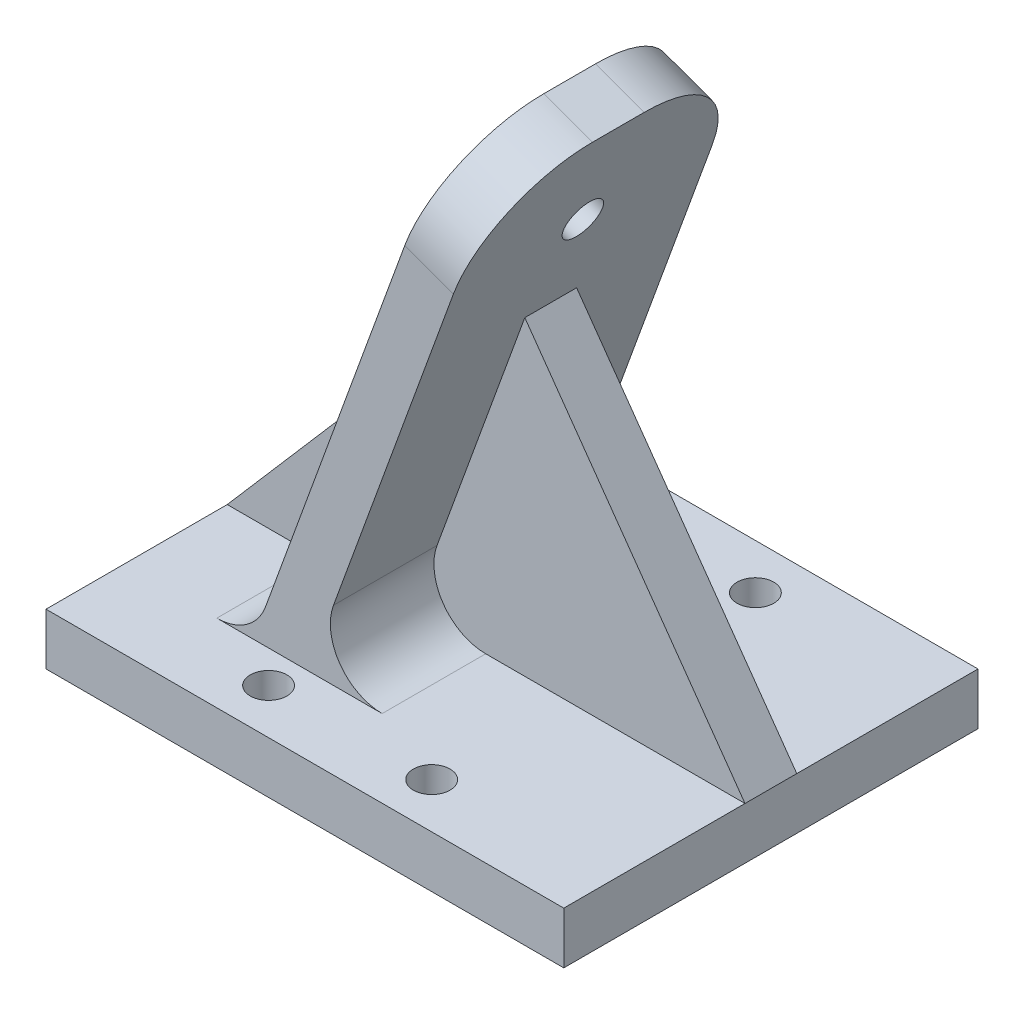
ISO-10303-21;
HEADER;
FILE_DESCRIPTION(('STEP AP214'),'2;1');
FILE_NAME('part.step','',(''),(''),'','','');
FILE_SCHEMA(('AUTOMOTIVE_DESIGN { 1 0 10303 214 1 1 1 1 }'));
ENDSEC;
DATA;
#1=APPLICATION_CONTEXT('core data for automotive mechanical design processes');
#2=APPLICATION_PROTOCOL_DEFINITION('international standard','automotive_design',2000,#1);
#3=PRODUCT_CONTEXT('',#1,'mechanical');
#4=PRODUCT('Part','Part','',(#3));
#5=PRODUCT_RELATED_PRODUCT_CATEGORY('part','',(#4));
#6=PRODUCT_DEFINITION_FORMATION('','',#4);
#7=PRODUCT_DEFINITION_CONTEXT('part definition',#1,'design');
#8=PRODUCT_DEFINITION('design','',#6,#7);
#9=PRODUCT_DEFINITION_SHAPE('','',#8);
#10=(LENGTH_UNIT() NAMED_UNIT(*) SI_UNIT(.MILLI.,.METRE.));
#11=(NAMED_UNIT(*) PLANE_ANGLE_UNIT() SI_UNIT($,.RADIAN.));
#12=(NAMED_UNIT(*) SI_UNIT($,.STERADIAN.) SOLID_ANGLE_UNIT());
#13=UNCERTAINTY_MEASURE_WITH_UNIT(LENGTH_MEASURE(1.E-05),#10,'distance_accuracy_value','');
#14=(GEOMETRIC_REPRESENTATION_CONTEXT(3) GLOBAL_UNCERTAINTY_ASSIGNED_CONTEXT((#13)) GLOBAL_UNIT_ASSIGNED_CONTEXT((#10,
#11,#12)) REPRESENTATION_CONTEXT('',''));
#15=CARTESIAN_POINT('',(0.,0.,0.));
#16=DIRECTION('',(0.,0.,1.));
#17=DIRECTION('',(1.,0.,0.));
#18=AXIS2_PLACEMENT_3D('',#15,#16,#17);
#19=CARTESIAN_POINT('',(0.,6.35,0.));
#20=DIRECTION('',(0.,-1.,0.));
#21=DIRECTION('',(0.,0.,-1.));
#22=AXIS2_PLACEMENT_3D('',#19,#20,#21);
#23=PLANE('',#22);
#24=CARTESIAN_POINT('',(-10.,6.35,-19.85));
#25=DIRECTION('',(0.,1.,0.));
#26=DIRECTION('',(0.,0.,1.));
#27=AXIS2_PLACEMENT_3D('',#24,#25,#26);
#28=CIRCLE('',#27,2.25);
#29=CARTESIAN_POINT('',(-10.,6.35,-17.6));
#30=VERTEX_POINT('',#29);
#31=EDGE_CURVE('E635',#30,#30,#28,.T.);
#32=ORIENTED_EDGE('',*,*,#31,.F.);
#33=EDGE_LOOP('',(#32));
#34=FACE_BOUND('',#33,.T.);
#35=CARTESIAN_POINT('',(10.,6.35,-19.85));
#36=DIRECTION('',(0.,1.,0.));
#37=DIRECTION('',(0.,0.,1.));
#38=AXIS2_PLACEMENT_3D('',#35,#36,#37);
#39=CIRCLE('',#38,2.25);
#40=CARTESIAN_POINT('',(10.,6.35,-17.6));
#41=VERTEX_POINT('',#40);
#42=EDGE_CURVE('E643',#41,#41,#39,.T.);
#43=ORIENTED_EDGE('',*,*,#42,.F.);
#44=EDGE_LOOP('',(#43));
#45=FACE_BOUND('',#44,.T.);
#46=DIRECTION('',(1.,0.,0.));
#47=VECTOR('',#46,1.);
#48=CARTESIAN_POINT('',(-31.75,6.35,-3.175));
#49=LINE('',#48,#47);
#50=CARTESIAN_POINT('',(-31.75,6.35,-3.175));
#51=VERTEX_POINT('',#50);
#52=CARTESIAN_POINT('',(-20.3226357352634,6.35,-3.175));
#53=VERTEX_POINT('',#52);
#54=EDGE_CURVE('E187',#51,#53,#49,.T.);
#55=ORIENTED_EDGE('',*,*,#54,.T.);
#56=DIRECTION('',(0.,0.,-1.));
#57=VECTOR('',#56,1.);
#58=CARTESIAN_POINT('',(-20.3226357352634,6.35,0.));
#59=LINE('',#58,#57);
#60=CARTESIAN_POINT('',(-20.3226357352634,6.35,-15.875));
#61=VERTEX_POINT('',#60);
#62=EDGE_CURVE('E173',#53,#61,#59,.T.);
#63=ORIENTED_EDGE('',*,*,#62,.T.);
#64=DIRECTION('',(1.,0.,0.));
#65=VECTOR('',#64,1.);
#66=CARTESIAN_POINT('',(0.,6.35,-15.875));
#67=LINE('',#66,#65);
#68=CARTESIAN_POINT('',(-0.0500491695972913,6.35,-15.875));
#69=VERTEX_POINT('',#68);
#70=EDGE_CURVE('E253',#61,#69,#67,.T.);
#71=ORIENTED_EDGE('',*,*,#70,.T.);
#72=DIRECTION('',(0.,0.,1.));
#73=VECTOR('',#72,1.);
#74=CARTESIAN_POINT('',(-0.0500491695972913,6.35,0.));
#75=LINE('',#74,#73);
#76=CARTESIAN_POINT('',(-0.0500491695972913,6.35,-3.175));
#77=VERTEX_POINT('',#76);
#78=EDGE_CURVE('E184',#69,#77,#75,.T.);
#79=ORIENTED_EDGE('',*,*,#78,.T.);
#80=DIRECTION('',(1.,0.,0.));
#81=VECTOR('',#80,1.);
#82=CARTESIAN_POINT('',(-0.0500491695972913,6.35,-3.175));
#83=LINE('',#82,#81);
#84=CARTESIAN_POINT('',(31.75,6.35,-3.175));
#85=VERTEX_POINT('',#84);
#86=EDGE_CURVE('E226',#77,#85,#83,.T.);
#87=ORIENTED_EDGE('',*,*,#86,.T.);
#88=DIRECTION('',(0.,0.,-1.));
#89=VECTOR('',#88,1.);
#90=CARTESIAN_POINT('',(31.75,6.35,25.4));
#91=LINE('',#90,#89);
#92=CARTESIAN_POINT('',(31.75,6.35,-25.4));
#93=VERTEX_POINT('',#92);
#94=EDGE_CURVE('E260',#85,#93,#91,.T.);
#95=ORIENTED_EDGE('',*,*,#94,.T.);
#96=DIRECTION('',(-1.,0.,0.));
#97=VECTOR('',#96,1.);
#98=CARTESIAN_POINT('',(-31.75,6.35,-25.4));
#99=LINE('',#98,#97);
#100=CARTESIAN_POINT('',(-31.75,6.35,-25.4));
#101=VERTEX_POINT('',#100);
#102=EDGE_CURVE('E259',#93,#101,#99,.T.);
#103=ORIENTED_EDGE('',*,*,#102,.T.);
#104=DIRECTION('',(0.,0.,1.));
#105=VECTOR('',#104,1.);
#106=CARTESIAN_POINT('',(-31.75,6.35,25.4));
#107=LINE('',#106,#105);
#108=EDGE_CURVE('E188',#101,#51,#107,.T.);
#109=ORIENTED_EDGE('',*,*,#108,.T.);
#110=EDGE_LOOP('',(#55,#63,#71,#79,#87,#95,#103,#109));
#111=FACE_BOUND('',#110,.T.);
#112=ADVANCED_FACE('F34',(#34,#45,#111),#23,.F.);
#113=CARTESIAN_POINT('',(-20.3226357352634,12.7,0.));
#114=DIRECTION('',(0.,0.,-1.));
#115=DIRECTION('',(-1.,0.,0.));
#116=AXIS2_PLACEMENT_3D('',#113,#114,#115);
#117=CYLINDRICAL_SURFACE('',#116,6.35);
#118=CARTESIAN_POINT('',(-20.3226357352634,12.7,-3.175));
#119=DIRECTION('',(0.,0.,1.));
#120=DIRECTION('',(1.,0.,0.));
#121=AXIS2_PLACEMENT_3D('',#118,#119,#120);
#122=CIRCLE('',#121,6.35);
#123=CARTESIAN_POINT('',(-14.3555875932728,10.528172089882,-3.175));
#124=VERTEX_POINT('',#123);
#125=EDGE_CURVE('E178',#53,#124,#122,.T.);
#126=ORIENTED_EDGE('',*,*,#125,.T.);
#127=DIRECTION('',(0.,0.,-1.));
#128=VECTOR('',#127,1.);
#129=CARTESIAN_POINT('',(-14.3555875932728,10.528172089882,-15.875));
#130=LINE('',#129,#128);
#131=CARTESIAN_POINT('',(-14.3555875932728,10.528172089882,-15.875));
#132=VERTEX_POINT('',#131);
#133=EDGE_CURVE('E310',#132,#124,#130,.F.);
#134=ORIENTED_EDGE('',*,*,#133,.F.);
#135=CARTESIAN_POINT('',(-20.3226357352634,12.7,-15.875));
#136=DIRECTION('',(0.,0.,-1.));
#137=DIRECTION('',(-1.,0.,0.));
#138=AXIS2_PLACEMENT_3D('',#135,#136,#137);
#139=CIRCLE('',#138,6.35);
#140=EDGE_CURVE('E180',#61,#132,#139,.F.);
#141=ORIENTED_EDGE('',*,*,#140,.F.);
#142=ORIENTED_EDGE('',*,*,#62,.F.);
#143=EDGE_LOOP('',(#126,#134,#141,#142));
#144=FACE_BOUND('',#143,.T.);
#145=ADVANCED_FACE('F175',(#144),#117,.F.);
#146=CARTESIAN_POINT('',(-0.0500491695972913,12.7,0.));
#147=DIRECTION('',(0.,0.,1.));
#148=DIRECTION('',(1.,0.,0.));
#149=AXIS2_PLACEMENT_3D('',#146,#147,#148);
#150=CYLINDRICAL_SURFACE('',#149,6.35);
#151=CARTESIAN_POINT('',(-0.0500491695972913,12.7,-3.175));
#152=DIRECTION('',(0.,0.,1.));
#153=DIRECTION('',(1.,0.,0.));
#154=AXIS2_PLACEMENT_3D('',#151,#152,#153);
#155=CIRCLE('',#154,6.35);
#156=CARTESIAN_POINT('',(-6.01709731158782,14.871827910118,-3.175));
#157=VERTEX_POINT('',#156);
#158=EDGE_CURVE('E224',#157,#77,#155,.T.);
#159=ORIENTED_EDGE('',*,*,#158,.T.);
#160=ORIENTED_EDGE('',*,*,#78,.F.);
#161=CARTESIAN_POINT('',(-0.0500491695972913,12.7,-15.875));
#162=DIRECTION('',(0.,0.,-1.));
#163=DIRECTION('',(-1.,0.,0.));
#164=AXIS2_PLACEMENT_3D('',#161,#162,#163);
#165=CIRCLE('',#164,6.35);
#166=CARTESIAN_POINT('',(-6.01709731158782,14.871827910118,-15.875));
#167=VERTEX_POINT('',#166);
#168=EDGE_CURVE('E11',#167,#69,#165,.F.);
#169=ORIENTED_EDGE('',*,*,#168,.F.);
#170=DIRECTION('',(0.,0.,1.));
#171=VECTOR('',#170,1.);
#172=CARTESIAN_POINT('',(-6.01709731158782,14.871827910118,-15.875));
#173=LINE('',#172,#171);
#174=EDGE_CURVE('E312',#157,#167,#173,.F.);
#175=ORIENTED_EDGE('',*,*,#174,.F.);
#176=EDGE_LOOP('',(#159,#160,#169,#175));
#177=FACE_BOUND('',#176,.T.);
#178=ADVANCED_FACE('F345',(#177),#150,.F.);
#179=CARTESIAN_POINT('',(31.75,6.35,25.4));
#180=DIRECTION('',(-1.,0.,0.));
#181=DIRECTION('',(0.,0.,1.));
#182=AXIS2_PLACEMENT_3D('',#179,#180,#181);
#183=PLANE('',#182);
#184=DIRECTION('',(0.,0.,-1.));
#185=VECTOR('',#184,1.);
#186=CARTESIAN_POINT('',(31.75,0.,25.4));
#187=LINE('',#186,#185);
#188=CARTESIAN_POINT('',(31.75,0.,25.4));
#189=VERTEX_POINT('',#188);
#190=CARTESIAN_POINT('',(31.75,0.,-25.4));
#191=VERTEX_POINT('',#190);
#192=EDGE_CURVE('E255',#189,#191,#187,.T.);
#193=ORIENTED_EDGE('',*,*,#192,.T.);
#194=DIRECTION('',(0.,-1.,0.));
#195=VECTOR('',#194,1.);
#196=CARTESIAN_POINT('',(31.75,6.35,-25.4));
#197=LINE('',#196,#195);
#198=EDGE_CURVE('E283',#93,#191,#197,.T.);
#199=ORIENTED_EDGE('',*,*,#198,.F.);
#200=ORIENTED_EDGE('',*,*,#94,.F.);
#201=DIRECTION('',(0.,0.,-1.));
#202=VECTOR('',#201,1.);
#203=CARTESIAN_POINT('',(31.75,6.35,3.175));
#204=LINE('',#203,#202);
#205=CARTESIAN_POINT('',(31.75,6.35,3.175));
#206=VERTEX_POINT('',#205);
#207=EDGE_CURVE('E231',#206,#85,#204,.T.);
#208=ORIENTED_EDGE('',*,*,#207,.F.);
#209=CARTESIAN_POINT('',(31.75,6.35,25.4));
#210=VERTEX_POINT('',#209);
#211=EDGE_CURVE('E256',#210,#206,#91,.T.);
#212=ORIENTED_EDGE('',*,*,#211,.F.);
#213=DIRECTION('',(0.,-1.,0.));
#214=VECTOR('',#213,1.);
#215=CARTESIAN_POINT('',(31.75,6.35,25.4));
#216=LINE('',#215,#214);
#217=EDGE_CURVE('E266',#210,#189,#216,.T.);
#218=ORIENTED_EDGE('',*,*,#217,.T.);
#219=EDGE_LOOP('',(#193,#199,#200,#208,#212,#218));
#220=FACE_BOUND('',#219,.T.);
#221=ADVANCED_FACE('F441',(#220),#183,.F.);
#222=CARTESIAN_POINT('',(-31.75,6.35,-25.4));
#223=DIRECTION('',(0.,0.,1.));
#224=DIRECTION('',(1.,0.,0.));
#225=AXIS2_PLACEMENT_3D('',#222,#223,#224);
#226=PLANE('',#225);
#227=DIRECTION('',(-1.,0.,0.));
#228=VECTOR('',#227,1.);
#229=CARTESIAN_POINT('',(-31.75,0.,-25.4));
#230=LINE('',#229,#228);
#231=CARTESIAN_POINT('',(-31.75,0.,-25.4));
#232=VERTEX_POINT('',#231);
#233=EDGE_CURVE('E269',#191,#232,#230,.T.);
#234=ORIENTED_EDGE('',*,*,#233,.T.);
#235=DIRECTION('',(0.,-1.,0.));
#236=VECTOR('',#235,1.);
#237=CARTESIAN_POINT('',(-31.75,6.35,-25.4));
#238=LINE('',#237,#236);
#239=EDGE_CURVE('E280',#101,#232,#238,.T.);
#240=ORIENTED_EDGE('',*,*,#239,.F.);
#241=ORIENTED_EDGE('',*,*,#102,.F.);
#242=ORIENTED_EDGE('',*,*,#198,.T.);
#243=EDGE_LOOP('',(#234,#240,#241,#242));
#244=FACE_BOUND('',#243,.T.);
#245=ADVANCED_FACE('F447',(#244),#226,.F.);
#246=CARTESIAN_POINT('',(-31.75,6.35,25.4));
#247=DIRECTION('',(1.,0.,0.));
#248=DIRECTION('',(0.,0.,-1.));
#249=AXIS2_PLACEMENT_3D('',#246,#247,#248);
#250=PLANE('',#249);
#251=DIRECTION('',(0.,0.,1.));
#252=VECTOR('',#251,1.);
#253=CARTESIAN_POINT('',(-31.75,0.,25.4));
#254=LINE('',#253,#252);
#255=CARTESIAN_POINT('',(-31.75,0.,25.4));
#256=VERTEX_POINT('',#255);
#257=EDGE_CURVE('E271',#232,#256,#254,.T.);
#258=ORIENTED_EDGE('',*,*,#257,.T.);
#259=DIRECTION('',(0.,-1.,0.));
#260=VECTOR('',#259,1.);
#261=CARTESIAN_POINT('',(-31.75,6.35,25.4));
#262=LINE('',#261,#260);
#263=CARTESIAN_POINT('',(-31.75,6.35,25.4));
#264=VERTEX_POINT('',#263);
#265=EDGE_CURVE('E277',#264,#256,#262,.T.);
#266=ORIENTED_EDGE('',*,*,#265,.F.);
#267=CARTESIAN_POINT('',(-31.75,6.35,3.175));
#268=VERTEX_POINT('',#267);
#269=EDGE_CURVE('E262',#268,#264,#107,.T.);
#270=ORIENTED_EDGE('',*,*,#269,.F.);
#271=DIRECTION('',(0.,0.,-1.));
#272=VECTOR('',#271,1.);
#273=CARTESIAN_POINT('',(-31.75,6.35,3.175));
#274=LINE('',#273,#272);
#275=EDGE_CURVE('E57',#268,#51,#274,.T.);
#276=ORIENTED_EDGE('',*,*,#275,.T.);
#277=ORIENTED_EDGE('',*,*,#108,.F.);
#278=ORIENTED_EDGE('',*,*,#239,.T.);
#279=EDGE_LOOP('',(#258,#266,#270,#276,#277,#278));
#280=FACE_BOUND('',#279,.T.);
#281=ADVANCED_FACE('F428',(#280),#250,.F.);
#282=CARTESIAN_POINT('',(-31.75,6.35,25.4));
#283=DIRECTION('',(0.,0.,-1.));
#284=DIRECTION('',(-1.,0.,0.));
#285=AXIS2_PLACEMENT_3D('',#282,#283,#284);
#286=PLANE('',#285);
#287=DIRECTION('',(1.,0.,0.));
#288=VECTOR('',#287,1.);
#289=CARTESIAN_POINT('',(-31.75,0.,25.4));
#290=LINE('',#289,#288);
#291=EDGE_CURVE('E273',#256,#189,#290,.T.);
#292=ORIENTED_EDGE('',*,*,#291,.T.);
#293=ORIENTED_EDGE('',*,*,#217,.F.);
#294=DIRECTION('',(1.,0.,0.));
#295=VECTOR('',#294,1.);
#296=CARTESIAN_POINT('',(-31.75,6.35,25.4));
#297=LINE('',#296,#295);
#298=EDGE_CURVE('E264',#264,#210,#297,.T.);
#299=ORIENTED_EDGE('',*,*,#298,.F.);
#300=ORIENTED_EDGE('',*,*,#265,.T.);
#301=EDGE_LOOP('',(#292,#293,#299,#300));
#302=FACE_BOUND('',#301,.T.);
#303=ADVANCED_FACE('F421',(#302),#286,.F.);
#304=CARTESIAN_POINT('',(-10.,6.35,19.85));
#305=DIRECTION('',(0.,1.,0.));
#306=DIRECTION('',(0.,0.,1.));
#307=AXIS2_PLACEMENT_3D('',#304,#305,#306);
#308=CIRCLE('',#307,2.25);
#309=CARTESIAN_POINT('',(-10.,6.35,22.1));
#310=VERTEX_POINT('',#309);
#311=EDGE_CURVE('E434',#310,#310,#308,.T.);
#312=ORIENTED_EDGE('',*,*,#311,.F.);
#313=EDGE_LOOP('',(#312));
#314=FACE_BOUND('',#313,.T.);
#315=CARTESIAN_POINT('',(10.,6.35,19.85));
#316=DIRECTION('',(0.,1.,0.));
#317=DIRECTION('',(0.,0.,1.));
#318=AXIS2_PLACEMENT_3D('',#315,#316,#317);
#319=CIRCLE('',#318,2.25);
#320=CARTESIAN_POINT('',(10.,6.35,22.1));
#321=VERTEX_POINT('',#320);
#322=EDGE_CURVE('E394',#321,#321,#319,.T.);
#323=ORIENTED_EDGE('',*,*,#322,.F.);
#324=EDGE_LOOP('',(#323));
#325=FACE_BOUND('',#324,.T.);
#326=CARTESIAN_POINT('',(-20.3226357352634,6.35,15.875));
#327=VERTEX_POINT('',#326);
#328=CARTESIAN_POINT('',(-20.3226357352634,6.35,3.175));
#329=VERTEX_POINT('',#328);
#330=EDGE_CURVE('E183',#327,#329,#59,.T.);
#331=ORIENTED_EDGE('',*,*,#330,.T.);
#332=DIRECTION('',(1.,0.,0.));
#333=VECTOR('',#332,1.);
#334=CARTESIAN_POINT('',(-31.75,6.35,3.175));
#335=LINE('',#334,#333);
#336=EDGE_CURVE('E50',#268,#329,#335,.T.);
#337=ORIENTED_EDGE('',*,*,#336,.F.);
#338=ORIENTED_EDGE('',*,*,#269,.T.);
#339=ORIENTED_EDGE('',*,*,#298,.T.);
#340=ORIENTED_EDGE('',*,*,#211,.T.);
#341=DIRECTION('',(1.,0.,0.));
#342=VECTOR('',#341,1.);
#343=CARTESIAN_POINT('',(-0.0500491695972913,6.35,3.175));
#344=LINE('',#343,#342);
#345=CARTESIAN_POINT('',(-0.0500491695972913,6.35,3.175));
#346=VERTEX_POINT('',#345);
#347=EDGE_CURVE('E215',#346,#206,#344,.T.);
#348=ORIENTED_EDGE('',*,*,#347,.F.);
#349=CARTESIAN_POINT('',(-0.0500491695972913,6.35,15.875));
#350=VERTEX_POINT('',#349);
#351=EDGE_CURVE('E306',#346,#350,#75,.T.);
#352=ORIENTED_EDGE('',*,*,#351,.T.);
#353=DIRECTION('',(1.,0.,0.));
#354=VECTOR('',#353,1.);
#355=CARTESIAN_POINT('',(0.,6.35,15.875));
#356=LINE('',#355,#354);
#357=EDGE_CURVE('E248',#327,#350,#356,.T.);
#358=ORIENTED_EDGE('',*,*,#357,.F.);
#359=EDGE_LOOP('',(#331,#337,#338,#339,#340,#348,#352,#358));
#360=FACE_BOUND('',#359,.T.);
#361=ADVANCED_FACE('F411',(#314,#325,#360),#23,.F.);
#362=CARTESIAN_POINT('',(0.,0.,0.));
#363=DIRECTION('',(0.,-1.,0.));
#364=DIRECTION('',(0.,0.,-1.));
#365=AXIS2_PLACEMENT_3D('',#362,#363,#364);
#366=PLANE('',#365);
#367=CARTESIAN_POINT('',(-10.,0.,19.85));
#368=DIRECTION('',(0.,1.,0.));
#369=DIRECTION('',(0.,0.,1.));
#370=AXIS2_PLACEMENT_3D('',#367,#368,#369);
#371=CIRCLE('',#370,2.25);
#372=CARTESIAN_POINT('',(-10.,0.,22.1));
#373=VERTEX_POINT('',#372);
#374=EDGE_CURVE('E633',#373,#373,#371,.T.);
#375=ORIENTED_EDGE('',*,*,#374,.T.);
#376=EDGE_LOOP('',(#375));
#377=FACE_BOUND('',#376,.T.);
#378=CARTESIAN_POINT('',(-10.,0.,-19.85));
#379=DIRECTION('',(0.,1.,0.));
#380=DIRECTION('',(0.,0.,1.));
#381=AXIS2_PLACEMENT_3D('',#378,#379,#380);
#382=CIRCLE('',#381,2.25);
#383=CARTESIAN_POINT('',(-10.,0.,-17.6));
#384=VERTEX_POINT('',#383);
#385=EDGE_CURVE('E640',#384,#384,#382,.T.);
#386=ORIENTED_EDGE('',*,*,#385,.T.);
#387=EDGE_LOOP('',(#386));
#388=FACE_BOUND('',#387,.T.);
#389=CARTESIAN_POINT('',(10.,0.,-19.85));
#390=DIRECTION('',(0.,1.,0.));
#391=DIRECTION('',(0.,0.,1.));
#392=AXIS2_PLACEMENT_3D('',#389,#390,#391);
#393=CIRCLE('',#392,2.25);
#394=CARTESIAN_POINT('',(10.,0.,-17.6));
#395=VERTEX_POINT('',#394);
#396=EDGE_CURVE('E646',#395,#395,#393,.T.);
#397=ORIENTED_EDGE('',*,*,#396,.T.);
#398=EDGE_LOOP('',(#397));
#399=FACE_BOUND('',#398,.T.);
#400=CARTESIAN_POINT('',(10.,0.,19.85));
#401=DIRECTION('',(0.,1.,0.));
#402=DIRECTION('',(0.,0.,1.));
#403=AXIS2_PLACEMENT_3D('',#400,#401,#402);
#404=CIRCLE('',#403,2.25);
#405=CARTESIAN_POINT('',(10.,0.,22.1));
#406=VERTEX_POINT('',#405);
#407=EDGE_CURVE('E389',#406,#406,#404,.T.);
#408=ORIENTED_EDGE('',*,*,#407,.T.);
#409=EDGE_LOOP('',(#408));
#410=FACE_BOUND('',#409,.T.);
#411=ORIENTED_EDGE('',*,*,#192,.F.);
#412=ORIENTED_EDGE('',*,*,#291,.F.);
#413=ORIENTED_EDGE('',*,*,#257,.F.);
#414=ORIENTED_EDGE('',*,*,#233,.F.);
#415=EDGE_LOOP('',(#411,#412,#413,#414));
#416=FACE_BOUND('',#415,.T.);
#417=ADVANCED_FACE('F420',(#377,#388,#399,#410,#416),#366,.T.);
#418=CARTESIAN_POINT('',(-17.3970481419905,2.17182791011796,-15.875));
#419=DIRECTION('',(-0.939692620785911,0.342020143325663,0.));
#420=DIRECTION('',(-0.342020143325663,-0.939692620785911,0.));
#421=AXIS2_PLACEMENT_3D('',#418,#419,#420);
#422=PLANE('',#421);
#423=CARTESIAN_POINT('',(2.72587045253304,57.4590923620961,0.));
#424=DIRECTION('',(-0.939692620785911,0.342020143325663,0.));
#425=DIRECTION('',(-0.342020143325663,-0.939692620785911,0.));
#426=AXIS2_PLACEMENT_3D('',#423,#424,#425);
#427=CIRCLE('',#426,2.413);
#428=CARTESIAN_POINT('',(1.90057584668822,55.1916140681397,0.));
#429=VERTEX_POINT('',#428);
#430=EDGE_CURVE('E385',#429,#429,#427,.T.);
#431=ORIENTED_EDGE('',*,*,#430,.F.);
#432=EDGE_LOOP('',(#431));
#433=FACE_BOUND('',#432,.T.);
#434=DIRECTION('',(0.342020143325663,0.93969262078591,0.));
#435=VECTOR('',#434,1.);
#436=CARTESIAN_POINT('',(-4.32026292967998,38.1,3.175));
#437=LINE('',#436,#435);
#438=CARTESIAN_POINT('',(-14.3555875932728,10.528172089882,3.175));
#439=VERTEX_POINT('',#438);
#440=CARTESIAN_POINT('',(-4.32026292967999,38.1,3.175));
#441=VERTEX_POINT('',#440);
#442=EDGE_CURVE('E205',#439,#441,#437,.T.);
#443=ORIENTED_EDGE('',*,*,#442,.F.);
#444=CARTESIAN_POINT('',(-14.3555875932728,10.528172089882,15.875));
#445=VERTEX_POINT('',#444);
#446=EDGE_CURVE('E309',#439,#445,#130,.F.);
#447=ORIENTED_EDGE('',*,*,#446,.T.);
#448=DIRECTION('',(-0.342020143325663,-0.93969262078591,0.));
#449=VECTOR('',#448,1.);
#450=CARTESIAN_POINT('',(-17.3970481419905,2.17182791011796,15.875));
#451=LINE('',#450,#449);
#452=CARTESIAN_POINT('',(2.72587045253305,57.4590923620961,15.875));
#453=VERTEX_POINT('',#452);
#454=EDGE_CURVE('E238',#453,#445,#451,.T.);
#455=ORIENTED_EDGE('',*,*,#454,.F.);
#456=CARTESIAN_POINT('',(2.72587045253305,57.4590923620961,3.175));
#457=DIRECTION('',(-0.939692620785911,0.342020143325663,0.));
#458=DIRECTION('',(-0.342020143325663,-0.939692620785911,0.));
#459=AXIS2_PLACEMENT_3D('',#456,#457,#458);
#460=CIRCLE('',#459,12.7);
#461=CARTESIAN_POINT('',(7.06952627276897,69.3931886460772,3.175));
#462=VERTEX_POINT('',#461);
#463=EDGE_CURVE('E291',#453,#462,#460,.T.);
#464=ORIENTED_EDGE('',*,*,#463,.T.);
#465=DIRECTION('',(0.,0.,1.));
#466=VECTOR('',#465,1.);
#467=CARTESIAN_POINT('',(7.06952627276897,69.3931886460772,-15.875));
#468=LINE('',#467,#466);
#469=CARTESIAN_POINT('',(7.06952627276897,69.3931886460772,-3.175));
#470=VERTEX_POINT('',#469);
#471=EDGE_CURVE('E245',#470,#462,#468,.T.);
#472=ORIENTED_EDGE('',*,*,#471,.F.);
#473=CARTESIAN_POINT('',(2.72587045253305,57.4590923620961,-3.175));
#474=DIRECTION('',(-0.939692620785911,0.342020143325663,0.));
#475=DIRECTION('',(-0.342020143325663,-0.939692620785911,0.));
#476=AXIS2_PLACEMENT_3D('',#473,#474,#475);
#477=CIRCLE('',#476,12.7);
#478=CARTESIAN_POINT('',(2.72587045253305,57.4590923620961,-15.875));
#479=VERTEX_POINT('',#478);
#480=EDGE_CURVE('E289',#470,#479,#477,.T.);
#481=ORIENTED_EDGE('',*,*,#480,.T.);
#482=DIRECTION('',(-0.342020143325663,-0.93969262078591,0.));
#483=VECTOR('',#482,1.);
#484=CARTESIAN_POINT('',(-17.3970481419905,2.17182791011796,-15.875));
#485=LINE('',#484,#483);
#486=EDGE_CURVE('E237',#479,#132,#485,.T.);
#487=ORIENTED_EDGE('',*,*,#486,.T.);
#488=ORIENTED_EDGE('',*,*,#133,.T.);
#489=DIRECTION('',(0.342020143325663,0.93969262078591,0.));
#490=VECTOR('',#489,1.);
#491=CARTESIAN_POINT('',(-4.32026292967998,38.1,-3.175));
#492=LINE('',#491,#490);
#493=CARTESIAN_POINT('',(-4.32026292967998,38.1,-3.175));
#494=VERTEX_POINT('',#493);
#495=EDGE_CURVE('E196',#124,#494,#492,.T.);
#496=ORIENTED_EDGE('',*,*,#495,.T.);
#497=DIRECTION('',(0.,0.,-1.));
#498=VECTOR('',#497,1.);
#499=CARTESIAN_POINT('',(-4.32026292967998,38.1,3.175));
#500=LINE('',#499,#498);
#501=EDGE_CURVE('E202',#441,#494,#500,.T.);
#502=ORIENTED_EDGE('',*,*,#501,.F.);
#503=EDGE_LOOP('',(#443,#447,#455,#464,#472,#481,#487,#488,#496,#502));
#504=FACE_BOUND('',#503,.T.);
#505=ADVANCED_FACE('F363',(#433,#504),#422,.T.);
#506=CARTESIAN_POINT('',(-11.43,0.,-15.875));
#507=DIRECTION('',(0.939692620785911,-0.342020143325663,0.));
#508=DIRECTION('',(0.342020143325663,0.939692620785911,0.));
#509=AXIS2_PLACEMENT_3D('',#506,#507,#508);
#510=PLANE('',#509);
#511=CARTESIAN_POINT('',(8.69291859452358,55.2872644519781,0.));
#512=DIRECTION('',(0.939692620785911,-0.342020143325663,0.));
#513=DIRECTION('',(0.342020143325663,0.939692620785911,0.));
#514=AXIS2_PLACEMENT_3D('',#511,#512,#513);
#515=CIRCLE('',#514,2.413);
#516=CARTESIAN_POINT('',(9.5182132003684,57.5547427459345,0.));
#517=VERTEX_POINT('',#516);
#518=EDGE_CURVE('E38',#517,#517,#515,.T.);
#519=ORIENTED_EDGE('',*,*,#518,.F.);
#520=EDGE_LOOP('',(#519));
#521=FACE_BOUND('',#520,.T.);
#522=DIRECTION('',(-0.342020143325663,-0.93969262078591,0.));
#523=VECTOR('',#522,1.);
#524=CARTESIAN_POINT('',(-6.01709731158782,14.871827910118,3.175));
#525=LINE('',#524,#523);
#526=CARTESIAN_POINT('',(4.74847691313239,44.45,3.175));
#527=VERTEX_POINT('',#526);
#528=CARTESIAN_POINT('',(-6.01709731158782,14.871827910118,3.175));
#529=VERTEX_POINT('',#528);
#530=EDGE_CURVE('E208',#527,#529,#525,.T.);
#531=ORIENTED_EDGE('',*,*,#530,.F.);
#532=DIRECTION('',(0.,0.,-1.));
#533=VECTOR('',#532,1.);
#534=CARTESIAN_POINT('',(4.74847691313239,44.45,3.175));
#535=LINE('',#534,#533);
#536=CARTESIAN_POINT('',(4.74847691313239,44.45,-3.175));
#537=VERTEX_POINT('',#536);
#538=EDGE_CURVE('E221',#527,#537,#535,.T.);
#539=ORIENTED_EDGE('',*,*,#538,.T.);
#540=DIRECTION('',(-0.342020143325663,-0.93969262078591,0.));
#541=VECTOR('',#540,1.);
#542=CARTESIAN_POINT('',(-6.01709731158782,14.871827910118,-3.175));
#543=LINE('',#542,#541);
#544=EDGE_CURVE('E207',#537,#157,#543,.T.);
#545=ORIENTED_EDGE('',*,*,#544,.T.);
#546=ORIENTED_EDGE('',*,*,#174,.T.);
#547=DIRECTION('',(0.342020143325663,0.93969262078591,0.));
#548=VECTOR('',#547,1.);
#549=CARTESIAN_POINT('',(-11.43,0.,-15.875));
#550=LINE('',#549,#548);
#551=CARTESIAN_POINT('',(8.69291859452358,55.2872644519781,-15.875));
#552=VERTEX_POINT('',#551);
#553=EDGE_CURVE('E235',#167,#552,#550,.T.);
#554=ORIENTED_EDGE('',*,*,#553,.T.);
#555=CARTESIAN_POINT('',(8.69291859452358,55.2872644519781,-3.175));
#556=DIRECTION('',(0.939692620785911,-0.342020143325663,0.));
#557=DIRECTION('',(0.342020143325663,0.939692620785911,0.));
#558=AXIS2_PLACEMENT_3D('',#555,#556,#557);
#559=CIRCLE('',#558,12.7);
#560=CARTESIAN_POINT('',(13.0365744147595,67.2213607359592,-3.175));
#561=VERTEX_POINT('',#560);
#562=EDGE_CURVE('E298',#552,#561,#559,.T.);
#563=ORIENTED_EDGE('',*,*,#562,.T.);
#564=DIRECTION('',(0.,0.,1.));
#565=VECTOR('',#564,1.);
#566=CARTESIAN_POINT('',(13.0365744147595,67.2213607359592,-15.875));
#567=LINE('',#566,#565);
#568=CARTESIAN_POINT('',(13.0365744147595,67.2213607359592,3.175));
#569=VERTEX_POINT('',#568);
#570=EDGE_CURVE('E241',#561,#569,#567,.T.);
#571=ORIENTED_EDGE('',*,*,#570,.T.);
#572=CARTESIAN_POINT('',(8.69291859452358,55.2872644519781,3.175));
#573=DIRECTION('',(0.939692620785911,-0.342020143325663,0.));
#574=DIRECTION('',(0.342020143325663,0.939692620785911,0.));
#575=AXIS2_PLACEMENT_3D('',#572,#573,#574);
#576=CIRCLE('',#575,12.7);
#577=CARTESIAN_POINT('',(8.69291859452357,55.2872644519781,15.875));
#578=VERTEX_POINT('',#577);
#579=EDGE_CURVE('E300',#569,#578,#576,.T.);
#580=ORIENTED_EDGE('',*,*,#579,.T.);
#581=DIRECTION('',(0.342020143325663,0.93969262078591,0.));
#582=VECTOR('',#581,1.);
#583=CARTESIAN_POINT('',(-11.43,0.,15.875));
#584=LINE('',#583,#582);
#585=CARTESIAN_POINT('',(-6.01709731158782,14.871827910118,15.875));
#586=VERTEX_POINT('',#585);
#587=EDGE_CURVE('E234',#586,#578,#584,.T.);
#588=ORIENTED_EDGE('',*,*,#587,.F.);
#589=EDGE_CURVE('E313',#586,#529,#173,.F.);
#590=ORIENTED_EDGE('',*,*,#589,.T.);
#591=EDGE_LOOP('',(#531,#539,#545,#546,#554,#563,#571,#580,#588,#590));
#592=FACE_BOUND('',#591,.T.);
#593=ADVANCED_FACE('F328',(#521,#592),#510,.T.);
#594=CARTESIAN_POINT('',(0.,0.,-15.875));
#595=DIRECTION('',(0.,0.,-1.));
#596=DIRECTION('',(-1.,0.,0.));
#597=AXIS2_PLACEMENT_3D('',#594,#595,#596);
#598=PLANE('',#597);
#599=ORIENTED_EDGE('',*,*,#486,.F.);
#600=DIRECTION('',(-0.93969262078591,0.342020143325665,0.));
#601=VECTOR('',#600,1.);
#602=CARTESIAN_POINT('',(18.7858625869487,51.6137332626196,-15.875));
#603=LINE('',#602,#601);
#604=EDGE_CURVE('E303',#479,#552,#603,.F.);
#605=ORIENTED_EDGE('',*,*,#604,.T.);
#606=ORIENTED_EDGE('',*,*,#553,.F.);
#607=ORIENTED_EDGE('',*,*,#168,.T.);
#608=ORIENTED_EDGE('',*,*,#70,.F.);
#609=ORIENTED_EDGE('',*,*,#140,.T.);
#610=EDGE_LOOP('',(#599,#605,#606,#607,#608,#609));
#611=FACE_BOUND('',#610,.T.);
#612=ADVANCED_FACE('F351',(#611),#598,.T.);
#613=CARTESIAN_POINT('',(0.,0.,15.875));
#614=DIRECTION('',(0.,0.,-1.));
#615=DIRECTION('',(-1.,0.,0.));
#616=AXIS2_PLACEMENT_3D('',#613,#614,#615);
#617=PLANE('',#616);
#618=ORIENTED_EDGE('',*,*,#357,.T.);
#619=CARTESIAN_POINT('',(-0.0500491695972913,12.7,15.875));
#620=DIRECTION('',(0.,0.,-1.));
#621=DIRECTION('',(-1.,0.,0.));
#622=AXIS2_PLACEMENT_3D('',#619,#620,#621);
#623=CIRCLE('',#622,6.35);
#624=EDGE_CURVE('E43',#350,#586,#623,.T.);
#625=ORIENTED_EDGE('',*,*,#624,.T.);
#626=ORIENTED_EDGE('',*,*,#587,.T.);
#627=DIRECTION('',(-0.93969262078591,0.342020143325665,0.));
#628=VECTOR('',#627,1.);
#629=CARTESIAN_POINT('',(2.72587045253303,57.4590923620961,15.875));
#630=LINE('',#629,#628);
#631=EDGE_CURVE('E286',#578,#453,#630,.T.);
#632=ORIENTED_EDGE('',*,*,#631,.T.);
#633=ORIENTED_EDGE('',*,*,#454,.T.);
#634=CARTESIAN_POINT('',(-20.3226357352634,12.7,15.875));
#635=DIRECTION('',(0.,0.,-1.));
#636=DIRECTION('',(-1.,0.,0.));
#637=AXIS2_PLACEMENT_3D('',#634,#635,#636);
#638=CIRCLE('',#637,6.35);
#639=EDGE_CURVE('E317',#445,#327,#638,.T.);
#640=ORIENTED_EDGE('',*,*,#639,.T.);
#641=EDGE_LOOP('',(#618,#625,#626,#632,#633,#640));
#642=FACE_BOUND('',#641,.T.);
#643=ADVANCED_FACE('F323',(#642),#617,.F.);
#644=CARTESIAN_POINT('',(13.0365744147595,67.2213607359592,-15.875));
#645=DIRECTION('',(0.342020143325665,0.93969262078591,0.));
#646=DIRECTION('',(-0.93969262078591,0.342020143325665,0.));
#647=AXIS2_PLACEMENT_3D('',#644,#645,#646);
#648=PLANE('',#647);
#649=ORIENTED_EDGE('',*,*,#471,.T.);
#650=DIRECTION('',(-0.93969262078591,0.342020143325665,0.));
#651=VECTOR('',#650,1.);
#652=CARTESIAN_POINT('',(13.0365744147595,67.2213607359592,3.175));
#653=LINE('',#652,#651);
#654=EDGE_CURVE('E296',#462,#569,#653,.F.);
#655=ORIENTED_EDGE('',*,*,#654,.T.);
#656=ORIENTED_EDGE('',*,*,#570,.F.);
#657=DIRECTION('',(-0.93969262078591,0.342020143325665,0.));
#658=VECTOR('',#657,1.);
#659=CARTESIAN_POINT('',(13.0365744147595,67.2213607359592,-3.175));
#660=LINE('',#659,#658);
#661=EDGE_CURVE('E293',#561,#470,#660,.T.);
#662=ORIENTED_EDGE('',*,*,#661,.T.);
#663=EDGE_LOOP('',(#649,#655,#656,#662));
#664=FACE_BOUND('',#663,.T.);
#665=ADVANCED_FACE('F358',(#664),#648,.T.);
#666=CARTESIAN_POINT('',(18.7858625869487,51.6137332626196,3.175));
#667=DIRECTION('',(0.93969262078591,-0.342020143325665,0.));
#668=DIRECTION('',(0.342020143325665,0.93969262078591,0.));
#669=AXIS2_PLACEMENT_3D('',#666,#667,#668);
#670=CYLINDRICAL_SURFACE('',#669,12.7);
#671=ORIENTED_EDGE('',*,*,#579,.F.);
#672=ORIENTED_EDGE('',*,*,#654,.F.);
#673=ORIENTED_EDGE('',*,*,#463,.F.);
#674=ORIENTED_EDGE('',*,*,#631,.F.);
#675=EDGE_LOOP('',(#671,#672,#673,#674));
#676=FACE_BOUND('',#675,.T.);
#677=ADVANCED_FACE('F366',(#676),#670,.T.);
#678=CARTESIAN_POINT('',(8.69291859452356,55.2872644519781,-3.175));
#679=DIRECTION('',(-0.93969262078591,0.342020143325665,0.));
#680=DIRECTION('',(-0.342020143325665,-0.93969262078591,0.));
#681=AXIS2_PLACEMENT_3D('',#678,#679,#680);
#682=CYLINDRICAL_SURFACE('',#681,12.7);
#683=ORIENTED_EDGE('',*,*,#562,.F.);
#684=ORIENTED_EDGE('',*,*,#604,.F.);
#685=ORIENTED_EDGE('',*,*,#480,.F.);
#686=ORIENTED_EDGE('',*,*,#661,.F.);
#687=EDGE_LOOP('',(#683,#684,#685,#686));
#688=FACE_BOUND('',#687,.T.);
#689=ADVANCED_FACE('F361',(#688),#682,.T.);
#690=ORIENTED_EDGE('',*,*,#446,.F.);
#691=CARTESIAN_POINT('',(-20.3226357352634,12.7,3.175));
#692=DIRECTION('',(0.,0.,1.));
#693=DIRECTION('',(1.,0.,0.));
#694=AXIS2_PLACEMENT_3D('',#691,#692,#693);
#695=CIRCLE('',#694,6.35);
#696=EDGE_CURVE('E374',#329,#439,#695,.T.);
#697=ORIENTED_EDGE('',*,*,#696,.F.);
#698=ORIENTED_EDGE('',*,*,#330,.F.);
#699=ORIENTED_EDGE('',*,*,#639,.F.);
#700=EDGE_LOOP('',(#690,#697,#698,#699));
#701=FACE_BOUND('',#700,.T.);
#702=ADVANCED_FACE('F372',(#701),#117,.F.);
#703=ORIENTED_EDGE('',*,*,#351,.F.);
#704=CARTESIAN_POINT('',(-0.0500491695972913,12.7,3.175));
#705=DIRECTION('',(0.,0.,1.));
#706=DIRECTION('',(1.,0.,0.));
#707=AXIS2_PLACEMENT_3D('',#704,#705,#706);
#708=CIRCLE('',#707,6.35);
#709=EDGE_CURVE('E211',#529,#346,#708,.T.);
#710=ORIENTED_EDGE('',*,*,#709,.F.);
#711=ORIENTED_EDGE('',*,*,#589,.F.);
#712=ORIENTED_EDGE('',*,*,#624,.F.);
#713=EDGE_LOOP('',(#703,#710,#711,#712));
#714=FACE_BOUND('',#713,.T.);
#715=ADVANCED_FACE('F36',(#714),#150,.F.);
#716=CARTESIAN_POINT('',(4.74847691313239,44.45,3.175));
#717=DIRECTION('',(-0.815882815110217,-0.578217287883912,0.));
#718=DIRECTION('',(0.578217287883913,-0.815882815110217,0.));
#719=AXIS2_PLACEMENT_3D('',#716,#717,#718);
#720=PLANE('',#719);
#721=DIRECTION('',(-0.578217287883913,0.815882815110217,0.));
#722=VECTOR('',#721,1.);
#723=CARTESIAN_POINT('',(4.74847691313239,44.45,-3.175));
#724=LINE('',#723,#722);
#725=EDGE_CURVE('E212',#85,#537,#724,.T.);
#726=ORIENTED_EDGE('',*,*,#725,.T.);
#727=ORIENTED_EDGE('',*,*,#538,.F.);
#728=DIRECTION('',(-0.578217287883913,0.815882815110217,0.));
#729=VECTOR('',#728,1.);
#730=CARTESIAN_POINT('',(4.74847691313239,44.45,3.175));
#731=LINE('',#730,#729);
#732=EDGE_CURVE('E218',#206,#527,#731,.T.);
#733=ORIENTED_EDGE('',*,*,#732,.F.);
#734=ORIENTED_EDGE('',*,*,#207,.T.);
#735=EDGE_LOOP('',(#726,#727,#733,#734));
#736=FACE_BOUND('',#735,.T.);
#737=ADVANCED_FACE('F339',(#736),#720,.F.);
#738=CARTESIAN_POINT('',(-0.0500491695972913,12.7,3.175));
#739=DIRECTION('',(0.,0.,1.));
#740=DIRECTION('',(1.,0.,0.));
#741=AXIS2_PLACEMENT_3D('',#738,#739,#740);
#742=PLANE('',#741);
#743=ORIENTED_EDGE('',*,*,#530,.T.);
#744=ORIENTED_EDGE('',*,*,#709,.T.);
#745=ORIENTED_EDGE('',*,*,#347,.T.);
#746=ORIENTED_EDGE('',*,*,#732,.T.);
#747=EDGE_LOOP('',(#743,#744,#745,#746));
#748=FACE_BOUND('',#747,.T.);
#749=ADVANCED_FACE('F332',(#748),#742,.T.);
#750=CARTESIAN_POINT('',(-0.0500491695972913,12.7,-3.175));
#751=DIRECTION('',(0.,0.,1.));
#752=DIRECTION('',(1.,0.,0.));
#753=AXIS2_PLACEMENT_3D('',#750,#751,#752);
#754=PLANE('',#753);
#755=ORIENTED_EDGE('',*,*,#544,.F.);
#756=ORIENTED_EDGE('',*,*,#725,.F.);
#757=ORIENTED_EDGE('',*,*,#86,.F.);
#758=ORIENTED_EDGE('',*,*,#158,.F.);
#759=EDGE_LOOP('',(#755,#756,#757,#758));
#760=FACE_BOUND('',#759,.T.);
#761=ADVANCED_FACE('F342',(#760),#754,.F.);
#762=CARTESIAN_POINT('',(-31.75,6.35,3.175));
#763=DIRECTION('',(0.756713557816875,-0.653746580424041,0.));
#764=DIRECTION('',(0.653746580424041,0.756713557816875,0.));
#765=AXIS2_PLACEMENT_3D('',#762,#763,#764);
#766=PLANE('',#765);
#767=DIRECTION('',(-0.653746580424041,-0.756713557816875,0.));
#768=VECTOR('',#767,1.);
#769=CARTESIAN_POINT('',(-31.75,6.35,-3.175));
#770=LINE('',#769,#768);
#771=EDGE_CURVE('E192',#494,#51,#770,.T.);
#772=ORIENTED_EDGE('',*,*,#771,.T.);
#773=ORIENTED_EDGE('',*,*,#275,.F.);
#774=DIRECTION('',(-0.653746580424041,-0.756713557816875,0.));
#775=VECTOR('',#774,1.);
#776=CARTESIAN_POINT('',(-31.75,6.35,3.175));
#777=LINE('',#776,#775);
#778=EDGE_CURVE('E198',#441,#268,#777,.T.);
#779=ORIENTED_EDGE('',*,*,#778,.F.);
#780=ORIENTED_EDGE('',*,*,#501,.T.);
#781=EDGE_LOOP('',(#772,#773,#779,#780));
#782=FACE_BOUND('',#781,.T.);
#783=ADVANCED_FACE('F397',(#782),#766,.F.);
#784=CARTESIAN_POINT('',(-20.3226357352634,12.7,3.175));
#785=DIRECTION('',(0.,0.,1.));
#786=DIRECTION('',(1.,0.,0.));
#787=AXIS2_PLACEMENT_3D('',#784,#785,#786);
#788=PLANE('',#787);
#789=ORIENTED_EDGE('',*,*,#778,.T.);
#790=ORIENTED_EDGE('',*,*,#336,.T.);
#791=ORIENTED_EDGE('',*,*,#696,.T.);
#792=ORIENTED_EDGE('',*,*,#442,.T.);
#793=EDGE_LOOP('',(#789,#790,#791,#792));
#794=FACE_BOUND('',#793,.T.);
#795=ADVANCED_FACE('F377',(#794),#788,.T.);
#796=CARTESIAN_POINT('',(-20.3226357352634,12.7,-3.175));
#797=DIRECTION('',(0.,0.,1.));
#798=DIRECTION('',(1.,0.,0.));
#799=AXIS2_PLACEMENT_3D('',#796,#797,#798);
#800=PLANE('',#799);
#801=ORIENTED_EDGE('',*,*,#771,.F.);
#802=ORIENTED_EDGE('',*,*,#495,.F.);
#803=ORIENTED_EDGE('',*,*,#125,.F.);
#804=ORIENTED_EDGE('',*,*,#54,.F.);
#805=EDGE_LOOP('',(#801,#802,#803,#804));
#806=FACE_BOUND('',#805,.T.);
#807=ADVANCED_FACE('F195',(#806),#800,.F.);
#808=CARTESIAN_POINT('',(46.8218181214625,41.409479958846,0.));
#809=DIRECTION('',(-0.93969262078591,0.342020143325663,0.));
#810=DIRECTION('',(-0.342020143325663,-0.939692620785911,0.));
#811=AXIS2_PLACEMENT_3D('',#808,#809,#810);
#812=CYLINDRICAL_SURFACE('',#811,2.413);
#813=ORIENTED_EDGE('',*,*,#518,.T.);
#814=EDGE_LOOP('',(#813));
#815=FACE_BOUND('',#814,.T.);
#816=ORIENTED_EDGE('',*,*,#430,.T.);
#817=EDGE_LOOP('',(#816));
#818=FACE_BOUND('',#817,.T.);
#819=ADVANCED_FACE('F577',(#815,#818),#812,.F.);
#820=CARTESIAN_POINT('',(10.,0.,19.85));
#821=DIRECTION('',(0.,1.,0.));
#822=DIRECTION('',(0.,0.,1.));
#823=AXIS2_PLACEMENT_3D('',#820,#821,#822);
#824=CYLINDRICAL_SURFACE('',#823,2.25);
#825=ORIENTED_EDGE('',*,*,#407,.F.);
#826=EDGE_LOOP('',(#825));
#827=FACE_BOUND('',#826,.T.);
#828=ORIENTED_EDGE('',*,*,#322,.T.);
#829=EDGE_LOOP('',(#828));
#830=FACE_BOUND('',#829,.T.);
#831=ADVANCED_FACE('F584',(#827,#830),#824,.F.);
#832=CARTESIAN_POINT('',(10.,0.,-19.85));
#833=DIRECTION('',(0.,1.,0.));
#834=DIRECTION('',(0.,0.,1.));
#835=AXIS2_PLACEMENT_3D('',#832,#833,#834);
#836=CYLINDRICAL_SURFACE('',#835,2.25);
#837=ORIENTED_EDGE('',*,*,#396,.F.);
#838=EDGE_LOOP('',(#837));
#839=FACE_BOUND('',#838,.T.);
#840=ORIENTED_EDGE('',*,*,#42,.T.);
#841=EDGE_LOOP('',(#840));
#842=FACE_BOUND('',#841,.T.);
#843=ADVANCED_FACE('F593',(#839,#842),#836,.F.);
#844=CARTESIAN_POINT('',(-10.,0.,-19.85));
#845=DIRECTION('',(0.,1.,0.));
#846=DIRECTION('',(0.,0.,1.));
#847=AXIS2_PLACEMENT_3D('',#844,#845,#846);
#848=CYLINDRICAL_SURFACE('',#847,2.25);
#849=ORIENTED_EDGE('',*,*,#385,.F.);
#850=EDGE_LOOP('',(#849));
#851=FACE_BOUND('',#850,.T.);
#852=ORIENTED_EDGE('',*,*,#31,.T.);
#853=EDGE_LOOP('',(#852));
#854=FACE_BOUND('',#853,.T.);
#855=ADVANCED_FACE('F603',(#851,#854),#848,.F.);
#856=CARTESIAN_POINT('',(-10.,0.,19.85));
#857=DIRECTION('',(0.,1.,0.));
#858=DIRECTION('',(0.,0.,1.));
#859=AXIS2_PLACEMENT_3D('',#856,#857,#858);
#860=CYLINDRICAL_SURFACE('',#859,2.25);
#861=ORIENTED_EDGE('',*,*,#374,.F.);
#862=EDGE_LOOP('',(#861));
#863=FACE_BOUND('',#862,.T.);
#864=ORIENTED_EDGE('',*,*,#311,.T.);
#865=EDGE_LOOP('',(#864));
#866=FACE_BOUND('',#865,.T.);
#867=ADVANCED_FACE('F612',(#863,#866),#860,.F.);
#868=CLOSED_SHELL('',(#112,#145,#178,#221,#245,#281,#303,#361,#417,#505,#593,#612,#643,#665,
#677,#689,#702,#715,#737,#749,#761,#783,#795,#807,#819,#831,#843,#855,#867));
#869=MANIFOLD_SOLID_BREP('B2',#868);
#870=ADVANCED_BREP_SHAPE_REPRESENTATION('',(#18,#869),#14);
#871=SHAPE_DEFINITION_REPRESENTATION(#9,#870);
ENDSEC;
END-ISO-10303-21;
